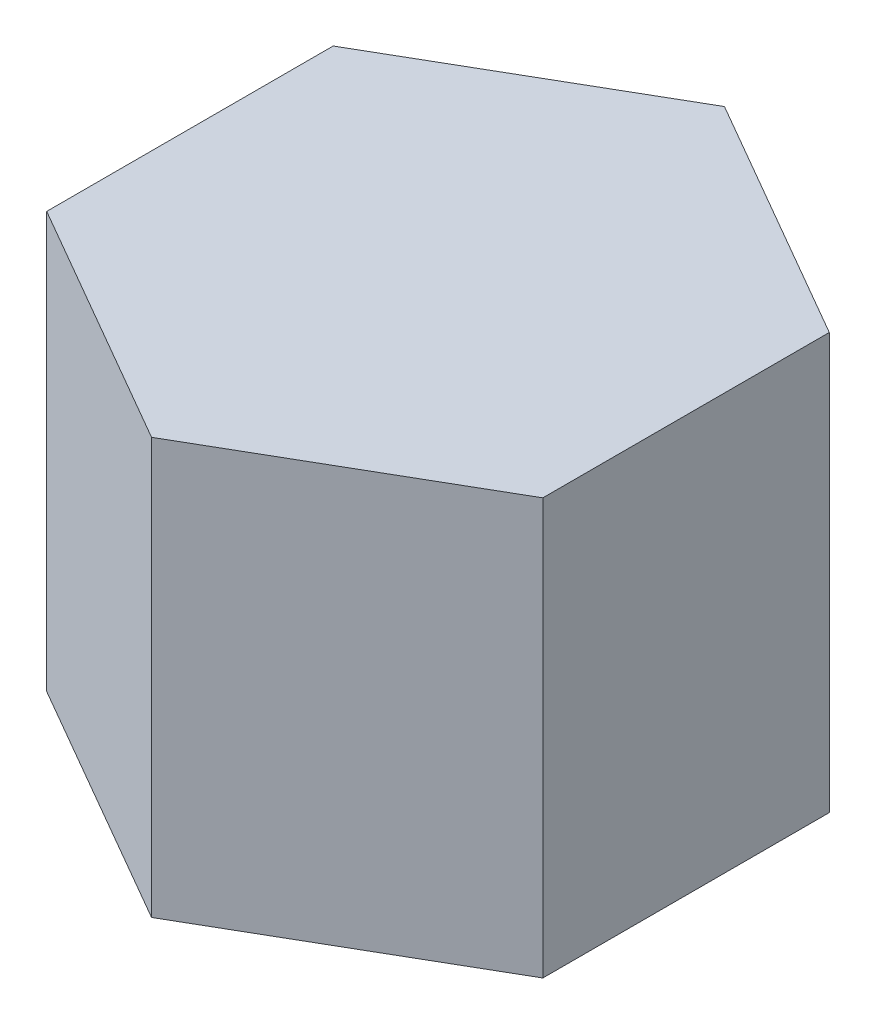
ISO-10303-21;
HEADER;
FILE_DESCRIPTION(('STEP AP214'),'2;1');
FILE_NAME('part.step','',(''),(''),'','','');
FILE_SCHEMA(('AUTOMOTIVE_DESIGN { 1 0 10303 214 1 1 1 1 }'));
ENDSEC;
DATA;
#1=APPLICATION_CONTEXT('core data for automotive mechanical design processes');
#2=APPLICATION_PROTOCOL_DEFINITION('international standard','automotive_design',2000,#1);
#3=PRODUCT_CONTEXT('',#1,'mechanical');
#4=PRODUCT('Part','Part','',(#3));
#5=PRODUCT_RELATED_PRODUCT_CATEGORY('part','',(#4));
#6=PRODUCT_DEFINITION_FORMATION('','',#4);
#7=PRODUCT_DEFINITION_CONTEXT('part definition',#1,'design');
#8=PRODUCT_DEFINITION('design','',#6,#7);
#9=PRODUCT_DEFINITION_SHAPE('','',#8);
#10=(LENGTH_UNIT() NAMED_UNIT(*) SI_UNIT(.MILLI.,.METRE.));
#11=(NAMED_UNIT(*) PLANE_ANGLE_UNIT() SI_UNIT($,.RADIAN.));
#12=(NAMED_UNIT(*) SI_UNIT($,.STERADIAN.) SOLID_ANGLE_UNIT());
#13=UNCERTAINTY_MEASURE_WITH_UNIT(LENGTH_MEASURE(1.E-05),#10,'distance_accuracy_value','');
#14=(GEOMETRIC_REPRESENTATION_CONTEXT(3) GLOBAL_UNCERTAINTY_ASSIGNED_CONTEXT((#13)) GLOBAL_UNIT_ASSIGNED_CONTEXT((#10,
#11,#12)) REPRESENTATION_CONTEXT('',''));
#15=CARTESIAN_POINT('',(0.,0.,0.));
#16=DIRECTION('',(0.,0.,1.));
#17=DIRECTION('',(1.,0.,0.));
#18=AXIS2_PLACEMENT_3D('',#15,#16,#17);
#19=CARTESIAN_POINT('',(202.142660308706,-148.537700895744,295.837098239417));
#20=DIRECTION('',(-0.500000000000062,0.,-0.866025403784403));
#21=DIRECTION('',(-0.866025403784403,0.,0.500000000000062));
#22=AXIS2_PLACEMENT_3D('',#19,#20,#21);
#23=PLANE('',#22);
#24=CARTESIAN_POINT('',(201.839551417381,-149.045793579175,296.012098239417));
#25=DIRECTION('',(0.866025403784403,0.,-0.500000000000062));
#26=VECTOR('',#25,1.);
#27=LINE('',#24,#26);
#28=CARTESIAN_POINT('',(201.839551417382,-149.045793579175,296.012098239417));
#29=VERTEX_POINT('',#28);
#30=CARTESIAN_POINT('',(202.142660308706,-149.045793579175,295.837098239417));
#31=VERTEX_POINT('',#30);
#32=EDGE_CURVE('E170',#29,#31,#27,.T.);
#33=ORIENTED_EDGE('',*,*,#32,.T.);
#34=CARTESIAN_POINT('',(202.142660308706,-148.537700895744,295.837098239417));
#35=DIRECTION('',(0.,-1.,0.));
#36=VECTOR('',#35,1.);
#37=LINE('',#34,#36);
#38=CARTESIAN_POINT('',(202.142660308706,-148.537700895744,295.837098239417));
#39=VERTEX_POINT('',#38);
#40=EDGE_CURVE('E35',#39,#31,#37,.T.);
#41=ORIENTED_EDGE('',*,*,#40,.F.);
#42=CARTESIAN_POINT('',(201.839551417381,-148.537700895744,296.012098239417));
#43=DIRECTION('',(0.866025403784403,0.,-0.500000000000062));
#44=VECTOR('',#43,1.);
#45=LINE('',#42,#44);
#46=CARTESIAN_POINT('',(201.839551417382,-148.537700895744,296.012098239417));
#47=VERTEX_POINT('',#46);
#48=EDGE_CURVE('E159',#47,#39,#45,.T.);
#49=ORIENTED_EDGE('',*,*,#48,.F.);
#50=CARTESIAN_POINT('',(201.839551417381,-148.537700895744,296.012098239417));
#51=DIRECTION('',(0.,-1.,0.));
#52=VECTOR('',#51,1.);
#53=LINE('',#50,#52);
#54=EDGE_CURVE('E10',#47,#29,#53,.T.);
#55=ORIENTED_EDGE('',*,*,#54,.T.);
#56=EDGE_LOOP('',(#33,#41,#49,#55));
#57=FACE_BOUND('',#56,.T.);
#58=ADVANCED_FACE('F16',(#57),#23,.F.);
#59=CARTESIAN_POINT('',(201.839551417382,-148.537700895744,296.012098239417));
#60=DIRECTION('',(0.499999999999978,0.,-0.866025403784452));
#61=DIRECTION('',(-0.866025403784452,0.,-0.499999999999978));
#62=AXIS2_PLACEMENT_3D('',#59,#60,#61);
#63=PLANE('',#62);
#64=CARTESIAN_POINT('',(201.536442526057,-149.045793579175,295.837098239417));
#65=DIRECTION('',(0.866025403784452,0.,0.499999999999978));
#66=VECTOR('',#65,1.);
#67=LINE('',#64,#66);
#68=CARTESIAN_POINT('',(201.536442526057,-149.045793579175,295.837098239417));
#69=VERTEX_POINT('',#68);
#70=EDGE_CURVE('E167',#69,#29,#67,.T.);
#71=ORIENTED_EDGE('',*,*,#70,.T.);
#72=ORIENTED_EDGE('',*,*,#54,.F.);
#73=CARTESIAN_POINT('',(201.536442526057,-148.537700895744,295.837098239417));
#74=DIRECTION('',(0.866025403784452,0.,0.499999999999978));
#75=VECTOR('',#74,1.);
#76=LINE('',#73,#75);
#77=CARTESIAN_POINT('',(201.536442526057,-148.537700895744,295.837098239417));
#78=VERTEX_POINT('',#77);
#79=EDGE_CURVE('E156',#78,#47,#76,.T.);
#80=ORIENTED_EDGE('',*,*,#79,.F.);
#81=CARTESIAN_POINT('',(201.536442526057,-148.537700895744,295.837098239417));
#82=DIRECTION('',(0.,-1.,0.));
#83=VECTOR('',#82,1.);
#84=LINE('',#81,#83);
#85=EDGE_CURVE('E27',#78,#69,#84,.T.);
#86=ORIENTED_EDGE('',*,*,#85,.T.);
#87=EDGE_LOOP('',(#71,#72,#80,#86));
#88=FACE_BOUND('',#87,.T.);
#89=ADVANCED_FACE('F189',(#88),#63,.F.);
#90=CARTESIAN_POINT('',(201.536442526057,-148.537700895744,290.831971220494));
#91=DIRECTION('',(1.,0.,0.));
#92=DIRECTION('',(0.,1.,0.));
#93=AXIS2_PLACEMENT_3D('',#90,#91,#92);
#94=PLANE('',#93);
#95=CARTESIAN_POINT('',(201.536442526057,-149.045793579175,295.487098239417));
#96=DIRECTION('',(0.,0.,1.));
#97=VECTOR('',#96,1.);
#98=LINE('',#95,#97);
#99=CARTESIAN_POINT('',(201.536442526057,-149.045793579175,295.487098239417));
#100=VERTEX_POINT('',#99);
#101=EDGE_CURVE('E163',#100,#69,#98,.T.);
#102=ORIENTED_EDGE('',*,*,#101,.T.);
#103=ORIENTED_EDGE('',*,*,#85,.F.);
#104=CARTESIAN_POINT('',(201.536442526057,-148.537700895744,295.487098239417));
#105=DIRECTION('',(0.,0.,1.));
#106=VECTOR('',#105,1.);
#107=LINE('',#104,#106);
#108=CARTESIAN_POINT('',(201.536442526057,-148.537700895744,295.487098239417));
#109=VERTEX_POINT('',#108);
#110=EDGE_CURVE('E106',#109,#78,#107,.T.);
#111=ORIENTED_EDGE('',*,*,#110,.F.);
#112=CARTESIAN_POINT('',(201.536442526057,-148.537700895744,295.487098239417));
#113=DIRECTION('',(0.,-1.,0.));
#114=VECTOR('',#113,1.);
#115=LINE('',#112,#114);
#116=EDGE_CURVE('E94',#109,#100,#115,.T.);
#117=ORIENTED_EDGE('',*,*,#116,.T.);
#118=EDGE_LOOP('',(#102,#103,#111,#117));
#119=FACE_BOUND('',#118,.T.);
#120=ADVANCED_FACE('F198',(#119),#94,.F.);
#121=CARTESIAN_POINT('',(201.536442526057,-148.537700895744,295.487098239417));
#122=DIRECTION('',(0.499999999999978,0.,0.866025403784452));
#123=DIRECTION('',(0.866025403784452,0.,-0.499999999999978));
#124=AXIS2_PLACEMENT_3D('',#121,#122,#123);
#125=PLANE('',#124);
#126=CARTESIAN_POINT('',(201.839551417382,-149.045793579175,295.312098239417));
#127=DIRECTION('',(-0.866025403784452,0.,0.499999999999978));
#128=VECTOR('',#127,1.);
#129=LINE('',#126,#128);
#130=CARTESIAN_POINT('',(201.839551417382,-149.045793579175,295.312098239417));
#131=VERTEX_POINT('',#130);
#132=EDGE_CURVE('E162',#131,#100,#129,.T.);
#133=ORIENTED_EDGE('',*,*,#132,.T.);
#134=ORIENTED_EDGE('',*,*,#116,.F.);
#135=CARTESIAN_POINT('',(201.839551417382,-148.537700895744,295.312098239417));
#136=DIRECTION('',(-0.866025403784452,0.,0.499999999999978));
#137=VECTOR('',#136,1.);
#138=LINE('',#135,#137);
#139=CARTESIAN_POINT('',(201.839551417382,-148.537700895744,295.312098239417));
#140=VERTEX_POINT('',#139);
#141=EDGE_CURVE('E98',#140,#109,#138,.T.);
#142=ORIENTED_EDGE('',*,*,#141,.F.);
#143=CARTESIAN_POINT('',(201.839551417382,-148.537700895744,295.312098239417));
#144=DIRECTION('',(0.,-1.,0.));
#145=VECTOR('',#144,1.);
#146=LINE('',#143,#145);
#147=EDGE_CURVE('E79',#140,#131,#146,.T.);
#148=ORIENTED_EDGE('',*,*,#147,.T.);
#149=EDGE_LOOP('',(#133,#134,#142,#148));
#150=FACE_BOUND('',#149,.T.);
#151=ADVANCED_FACE('F100',(#150),#125,.F.);
#152=CARTESIAN_POINT('',(201.839551417382,-148.537700895744,295.312098239417));
#153=DIRECTION('',(-0.499999999999978,0.,0.866025403784452));
#154=DIRECTION('',(0.866025403784452,0.,0.499999999999978));
#155=AXIS2_PLACEMENT_3D('',#152,#153,#154);
#156=PLANE('',#155);
#157=CARTESIAN_POINT('',(202.142660308706,-149.045793579175,295.487098239417));
#158=DIRECTION('',(-0.866025403784452,0.,-0.499999999999978));
#159=VECTOR('',#158,1.);
#160=LINE('',#157,#159);
#161=CARTESIAN_POINT('',(202.142660308706,-149.045793579175,295.487098239417));
#162=VERTEX_POINT('',#161);
#163=EDGE_CURVE('E88',#162,#131,#160,.T.);
#164=ORIENTED_EDGE('',*,*,#163,.T.);
#165=ORIENTED_EDGE('',*,*,#147,.F.);
#166=CARTESIAN_POINT('',(202.142660308706,-148.537700895744,295.487098239417));
#167=DIRECTION('',(-0.866025403784452,0.,-0.499999999999978));
#168=VECTOR('',#167,1.);
#169=LINE('',#166,#168);
#170=CARTESIAN_POINT('',(202.142660308706,-148.537700895744,295.487098239417));
#171=VERTEX_POINT('',#170);
#172=EDGE_CURVE('E84',#171,#140,#169,.T.);
#173=ORIENTED_EDGE('',*,*,#172,.F.);
#174=CARTESIAN_POINT('',(202.142660308706,-148.537700895744,295.487098239417));
#175=DIRECTION('',(0.,-1.,0.));
#176=VECTOR('',#175,1.);
#177=LINE('',#174,#176);
#178=EDGE_CURVE('E58',#171,#162,#177,.T.);
#179=ORIENTED_EDGE('',*,*,#178,.T.);
#180=EDGE_LOOP('',(#164,#165,#173,#179));
#181=FACE_BOUND('',#180,.T.);
#182=ADVANCED_FACE('F82',(#181),#156,.F.);
#183=CARTESIAN_POINT('',(202.142660308706,-148.537700895744,290.831971220494));
#184=DIRECTION('',(-1.,0.,0.));
#185=DIRECTION('',(0.,-1.,0.));
#186=AXIS2_PLACEMENT_3D('',#183,#184,#185);
#187=PLANE('',#186);
#188=CARTESIAN_POINT('',(202.142660308706,-149.045793579175,295.837098239417));
#189=DIRECTION('',(0.,0.,-1.));
#190=VECTOR('',#189,1.);
#191=LINE('',#188,#190);
#192=EDGE_CURVE('E160',#31,#162,#191,.T.);
#193=ORIENTED_EDGE('',*,*,#192,.T.);
#194=ORIENTED_EDGE('',*,*,#178,.F.);
#195=CARTESIAN_POINT('',(202.142660308706,-148.537700895744,295.837098239417));
#196=DIRECTION('',(0.,0.,-1.));
#197=VECTOR('',#196,1.);
#198=LINE('',#195,#197);
#199=EDGE_CURVE('E112',#39,#171,#198,.T.);
#200=ORIENTED_EDGE('',*,*,#199,.F.);
#201=ORIENTED_EDGE('',*,*,#40,.T.);
#202=EDGE_LOOP('',(#193,#194,#200,#201));
#203=FACE_BOUND('',#202,.T.);
#204=ADVANCED_FACE('F131',(#203),#187,.F.);
#205=CARTESIAN_POINT('',(206.339551417382,-148.537700895744,290.831971220494));
#206=DIRECTION('',(0.,-1.,0.));
#207=DIRECTION('',(1.,0.,0.));
#208=AXIS2_PLACEMENT_3D('',#205,#206,#207);
#209=PLANE('',#208);
#210=ORIENTED_EDGE('',*,*,#48,.T.);
#211=ORIENTED_EDGE('',*,*,#199,.T.);
#212=ORIENTED_EDGE('',*,*,#172,.T.);
#213=ORIENTED_EDGE('',*,*,#141,.T.);
#214=ORIENTED_EDGE('',*,*,#110,.T.);
#215=ORIENTED_EDGE('',*,*,#79,.T.);
#216=EDGE_LOOP('',(#210,#211,#212,#213,#214,#215));
#217=FACE_BOUND('',#216,.T.);
#218=ADVANCED_FACE('F111',(#217),#209,.F.);
#219=CARTESIAN_POINT('',(206.339551417382,-149.045793579175,290.831971220494));
#220=DIRECTION('',(0.,-1.,0.));
#221=DIRECTION('',(1.,0.,0.));
#222=AXIS2_PLACEMENT_3D('',#219,#220,#221);
#223=PLANE('',#222);
#224=ORIENTED_EDGE('',*,*,#32,.F.);
#225=ORIENTED_EDGE('',*,*,#70,.F.);
#226=ORIENTED_EDGE('',*,*,#101,.F.);
#227=ORIENTED_EDGE('',*,*,#132,.F.);
#228=ORIENTED_EDGE('',*,*,#163,.F.);
#229=ORIENTED_EDGE('',*,*,#192,.F.);
#230=EDGE_LOOP('',(#224,#225,#226,#227,#228,#229));
#231=FACE_BOUND('',#230,.T.);
#232=ADVANCED_FACE('F130',(#231),#223,.T.);
#233=CLOSED_SHELL('',(#58,#89,#120,#151,#182,#204,#218,#232));
#234=MANIFOLD_SOLID_BREP('B1',#233);
#235=ADVANCED_BREP_SHAPE_REPRESENTATION('',(#18,#234),#14);
#236=SHAPE_DEFINITION_REPRESENTATION(#9,#235);
ENDSEC;
END-ISO-10303-21;
